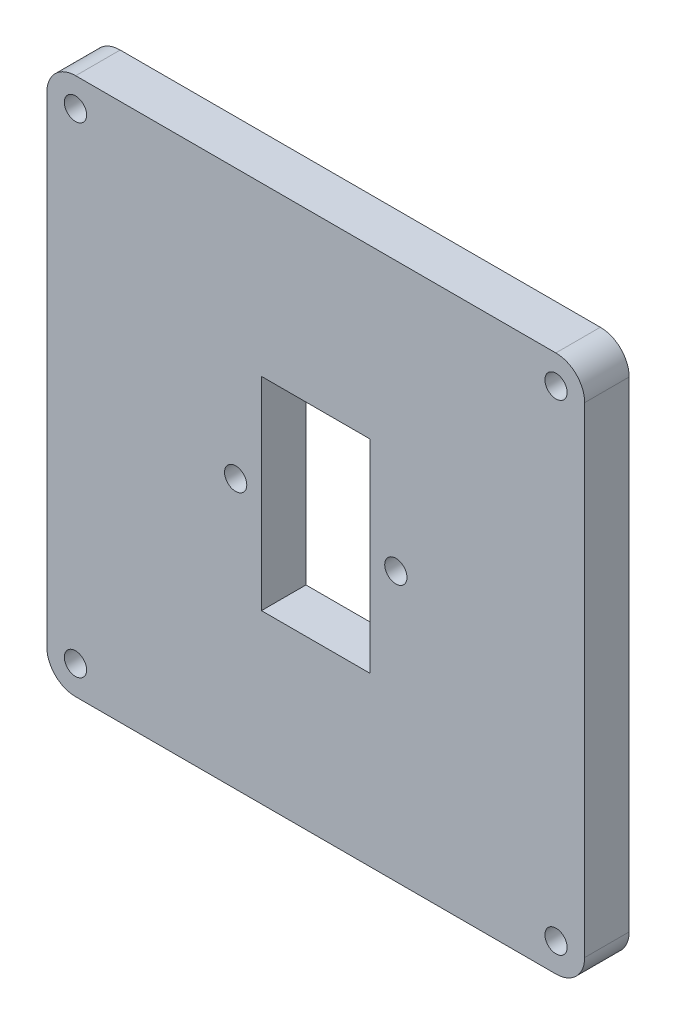
ISO-10303-21;
HEADER;
FILE_DESCRIPTION(('STEP AP214'),'2;1');
FILE_NAME('part.step','',(''),(''),'','','');
FILE_SCHEMA(('AUTOMOTIVE_DESIGN { 1 0 10303 214 1 1 1 1 }'));
ENDSEC;
DATA;
#1=APPLICATION_CONTEXT('core data for automotive mechanical design processes');
#2=APPLICATION_PROTOCOL_DEFINITION('international standard','automotive_design',2000,#1);
#3=PRODUCT_CONTEXT('',#1,'mechanical');
#4=PRODUCT('Part','Part','',(#3));
#5=PRODUCT_RELATED_PRODUCT_CATEGORY('part','',(#4));
#6=PRODUCT_DEFINITION_FORMATION('','',#4);
#7=PRODUCT_DEFINITION_CONTEXT('part definition',#1,'design');
#8=PRODUCT_DEFINITION('design','',#6,#7);
#9=PRODUCT_DEFINITION_SHAPE('','',#8);
#10=(LENGTH_UNIT() NAMED_UNIT(*) SI_UNIT(.MILLI.,.METRE.));
#11=(NAMED_UNIT(*) PLANE_ANGLE_UNIT() SI_UNIT($,.RADIAN.));
#12=(NAMED_UNIT(*) SI_UNIT($,.STERADIAN.) SOLID_ANGLE_UNIT());
#13=UNCERTAINTY_MEASURE_WITH_UNIT(LENGTH_MEASURE(1.E-05),#10,'distance_accuracy_value','');
#14=(GEOMETRIC_REPRESENTATION_CONTEXT(3) GLOBAL_UNCERTAINTY_ASSIGNED_CONTEXT((#13)) GLOBAL_UNIT_ASSIGNED_CONTEXT((#10,
#11,#12)) REPRESENTATION_CONTEXT('',''));
#15=CARTESIAN_POINT('',(0.,0.,0.));
#16=DIRECTION('',(0.,0.,1.));
#17=DIRECTION('',(1.,0.,0.));
#18=AXIS2_PLACEMENT_3D('',#15,#16,#17);
#19=CARTESIAN_POINT('',(0.,1640.52370089279,5.));
#20=DIRECTION('',(0.,1.,0.));
#21=DIRECTION('',(0.,0.,1.));
#22=AXIS2_PLACEMENT_3D('',#19,#20,#21);
#23=PLANE('',#22);
#24=DIRECTION('',(1.,0.,0.));
#25=VECTOR('',#24,1.);
#26=CARTESIAN_POINT('',(0.,1640.52370089279,0.));
#27=LINE('',#26,#25);
#28=CARTESIAN_POINT('',(2386.48084118591,1640.52370089279,0.));
#29=VERTEX_POINT('',#28);
#30=CARTESIAN_POINT('',(2440.43389202825,1640.52370089279,0.));
#31=VERTEX_POINT('',#30);
#32=EDGE_CURVE('E210',#29,#31,#27,.T.);
#33=ORIENTED_EDGE('',*,*,#32,.F.);
#34=DIRECTION('',(0.,0.,-1.));
#35=VECTOR('',#34,1.);
#36=CARTESIAN_POINT('',(2386.48084118591,1640.52370089279,5.));
#37=LINE('',#36,#35);
#38=CARTESIAN_POINT('',(2386.48084118591,1640.52370089279,5.));
#39=VERTEX_POINT('',#38);
#40=EDGE_CURVE('E11',#39,#29,#37,.T.);
#41=ORIENTED_EDGE('',*,*,#40,.F.);
#42=DIRECTION('',(1.,0.,0.));
#43=VECTOR('',#42,1.);
#44=CARTESIAN_POINT('',(0.,1640.52370089279,5.));
#45=LINE('',#44,#43);
#46=CARTESIAN_POINT('',(2440.43389202825,1640.52370089279,5.));
#47=VERTEX_POINT('',#46);
#48=EDGE_CURVE('E298',#39,#47,#45,.T.);
#49=ORIENTED_EDGE('',*,*,#48,.T.);
#50=DIRECTION('',(0.,0.,-1.));
#51=VECTOR('',#50,1.);
#52=CARTESIAN_POINT('',(2440.43389202825,1640.52370089279,5.));
#53=LINE('',#52,#51);
#54=EDGE_CURVE('E107',#47,#31,#53,.T.);
#55=ORIENTED_EDGE('',*,*,#54,.T.);
#56=EDGE_LOOP('',(#33,#41,#49,#55));
#57=FACE_BOUND('',#56,.T.);
#58=ADVANCED_FACE('F41',(#57),#23,.T.);
#59=CARTESIAN_POINT('',(2386.45736255729,1637.30587108874,5.));
#60=DIRECTION('',(0.,0.,-1.));
#61=DIRECTION('',(-1.,0.,0.));
#62=AXIS2_PLACEMENT_3D('',#59,#60,#61);
#63=CYLINDRICAL_SURFACE('',#62,3.21791545784592);
#64=CARTESIAN_POINT('',(2386.45736255729,1637.30587108874,0.));
#65=DIRECTION('',(0.,0.,1.));
#66=DIRECTION('',(1.,0.,0.));
#67=AXIS2_PLACEMENT_3D('',#64,#65,#66);
#68=CIRCLE('',#67,3.21791545784592);
#69=CARTESIAN_POINT('',(2383.23944711969,1637.30623207254,0.));
#70=VERTEX_POINT('',#69);
#71=EDGE_CURVE('E214',#29,#70,#68,.T.);
#72=ORIENTED_EDGE('',*,*,#71,.T.);
#73=DIRECTION('',(0.,0.,-1.));
#74=VECTOR('',#73,1.);
#75=CARTESIAN_POINT('',(2383.23944711969,1637.30623207254,5.));
#76=LINE('',#75,#74);
#77=CARTESIAN_POINT('',(2383.23944711969,1637.30623207254,5.));
#78=VERTEX_POINT('',#77);
#79=EDGE_CURVE('E52',#78,#70,#76,.T.);
#80=ORIENTED_EDGE('',*,*,#79,.F.);
#81=CARTESIAN_POINT('',(2386.45736255729,1637.30587108874,5.));
#82=DIRECTION('',(0.,0.,1.));
#83=DIRECTION('',(1.,0.,0.));
#84=AXIS2_PLACEMENT_3D('',#81,#82,#83);
#85=CIRCLE('',#84,3.21791545784592);
#86=EDGE_CURVE('E301',#39,#78,#85,.T.);
#87=ORIENTED_EDGE('',*,*,#86,.F.);
#88=ORIENTED_EDGE('',*,*,#40,.T.);
#89=EDGE_LOOP('',(#72,#80,#87,#88));
#90=FACE_BOUND('',#89,.T.);
#91=ADVANCED_FACE('F323',(#90),#63,.T.);
#92=CARTESIAN_POINT('',(2383.23944650581,-8.93553077367108E-07,5.));
#93=DIRECTION('',(-1.,3.74932144848975E-10,0.));
#94=DIRECTION('',(-3.74932144848975E-10,-1.,0.));
#95=AXIS2_PLACEMENT_3D('',#92,#93,#94);
#96=PLANE('',#95);
#97=DIRECTION('',(3.74932144848975E-10,1.,0.));
#98=VECTOR('',#97,1.);
#99=CARTESIAN_POINT('',(2383.23944650581,-8.93553077367108E-07,0.));
#100=LINE('',#99,#98);
#101=CARTESIAN_POINT('',(2383.23944709944,1583.30587108874,0.));
#102=VERTEX_POINT('',#101);
#103=EDGE_CURVE('E218',#102,#70,#100,.T.);
#104=ORIENTED_EDGE('',*,*,#103,.F.);
#105=DIRECTION('',(0.,0.,-1.));
#106=VECTOR('',#105,1.);
#107=CARTESIAN_POINT('',(2383.23944709944,1583.30587108874,5.));
#108=LINE('',#107,#106);
#109=CARTESIAN_POINT('',(2383.23944709944,1583.30587108874,5.));
#110=VERTEX_POINT('',#109);
#111=EDGE_CURVE('E248',#110,#102,#108,.T.);
#112=ORIENTED_EDGE('',*,*,#111,.F.);
#113=DIRECTION('',(3.74932144848975E-10,1.,0.));
#114=VECTOR('',#113,1.);
#115=CARTESIAN_POINT('',(2383.23944650581,-8.93553077367108E-07,5.));
#116=LINE('',#115,#114);
#117=EDGE_CURVE('E304',#110,#78,#116,.T.);
#118=ORIENTED_EDGE('',*,*,#117,.T.);
#119=ORIENTED_EDGE('',*,*,#79,.T.);
#120=EDGE_LOOP('',(#104,#112,#118,#119));
#121=FACE_BOUND('',#120,.T.);
#122=ADVANCED_FACE('F326',(#121),#96,.T.);
#123=CARTESIAN_POINT('',(2386.45736255729,1583.30587108874,5.));
#124=DIRECTION('',(0.,0.,-1.));
#125=DIRECTION('',(-1.,0.,0.));
#126=AXIS2_PLACEMENT_3D('',#123,#124,#125);
#127=CYLINDRICAL_SURFACE('',#126,3.21791545784508);
#128=CARTESIAN_POINT('',(2386.45736255729,1583.30587108874,0.));
#129=DIRECTION('',(0.,0.,1.));
#130=DIRECTION('',(1.,0.,0.));
#131=AXIS2_PLACEMENT_3D('',#128,#129,#130);
#132=CIRCLE('',#131,3.21791545784508);
#133=CARTESIAN_POINT('',(2386.48269411464,1580.08805533795,0.));
#134=VERTEX_POINT('',#133);
#135=EDGE_CURVE('E222',#102,#134,#132,.T.);
#136=ORIENTED_EDGE('',*,*,#135,.T.);
#137=DIRECTION('',(0.,0.,-1.));
#138=VECTOR('',#137,1.);
#139=CARTESIAN_POINT('',(2386.48269411464,1580.08805533795,5.));
#140=LINE('',#139,#138);
#141=CARTESIAN_POINT('',(2386.48269411464,1580.08805533795,5.));
#142=VERTEX_POINT('',#141);
#143=EDGE_CURVE('E245',#142,#134,#140,.T.);
#144=ORIENTED_EDGE('',*,*,#143,.F.);
#145=CARTESIAN_POINT('',(2386.45736255729,1583.30587108874,5.));
#146=DIRECTION('',(0.,0.,1.));
#147=DIRECTION('',(1.,0.,0.));
#148=AXIS2_PLACEMENT_3D('',#145,#146,#147);
#149=CIRCLE('',#148,3.21791545784508);
#150=EDGE_CURVE('E308',#110,#142,#149,.T.);
#151=ORIENTED_EDGE('',*,*,#150,.F.);
#152=ORIENTED_EDGE('',*,*,#111,.T.);
#153=EDGE_LOOP('',(#136,#144,#151,#152));
#154=FACE_BOUND('',#153,.T.);
#155=ADVANCED_FACE('F329',(#154),#127,.T.);
#156=CARTESIAN_POINT('',(1.95099696627954E-11,1580.08805533798,5.));
#157=DIRECTION('',(0.,-1.,0.));
#158=DIRECTION('',(1.,0.,0.));
#159=AXIS2_PLACEMENT_3D('',#156,#157,#158);
#160=PLANE('',#159);
#161=DIRECTION('',(-1.,0.,0.));
#162=VECTOR('',#161,1.);
#163=CARTESIAN_POINT('',(1.95099696627954E-11,1580.08805533798,0.));
#164=LINE('',#163,#162);
#165=CARTESIAN_POINT('',(2440.43203909953,1580.08805533795,0.));
#166=VERTEX_POINT('',#165);
#167=EDGE_CURVE('E226',#166,#134,#164,.T.);
#168=ORIENTED_EDGE('',*,*,#167,.F.);
#169=DIRECTION('',(0.,0.,-1.));
#170=VECTOR('',#169,1.);
#171=CARTESIAN_POINT('',(2440.43203909953,1580.08805533795,5.));
#172=LINE('',#171,#170);
#173=CARTESIAN_POINT('',(2440.43203909953,1580.08805533795,5.));
#174=VERTEX_POINT('',#173);
#175=EDGE_CURVE('E160',#174,#166,#172,.T.);
#176=ORIENTED_EDGE('',*,*,#175,.F.);
#177=DIRECTION('',(-1.,0.,0.));
#178=VECTOR('',#177,1.);
#179=CARTESIAN_POINT('',(1.95099696627954E-11,1580.08805533798,5.));
#180=LINE('',#179,#178);
#181=EDGE_CURVE('E147',#174,#142,#180,.T.);
#182=ORIENTED_EDGE('',*,*,#181,.T.);
#183=ORIENTED_EDGE('',*,*,#143,.T.);
#184=EDGE_LOOP('',(#168,#176,#182,#183));
#185=FACE_BOUND('',#184,.T.);
#186=ADVANCED_FACE('F313',(#185),#160,.T.);
#187=CARTESIAN_POINT('',(2440.45736255729,1583.30587108874,5.));
#188=DIRECTION('',(0.,0.,-1.));
#189=DIRECTION('',(-1.,0.,0.));
#190=AXIS2_PLACEMENT_3D('',#187,#188,#189);
#191=CYLINDRICAL_SURFACE('',#190,3.21791539409568);
#192=CARTESIAN_POINT('',(2440.45736255729,1583.30587108874,0.));
#193=DIRECTION('',(0.,0.,1.));
#194=DIRECTION('',(1.,0.,0.));
#195=AXIS2_PLACEMENT_3D('',#192,#193,#194);
#196=CIRCLE('',#195,3.21791539409568);
#197=CARTESIAN_POINT('',(2443.6752779334,1583.30621128496,0.));
#198=VERTEX_POINT('',#197);
#199=EDGE_CURVE('E155',#166,#198,#196,.T.);
#200=ORIENTED_EDGE('',*,*,#199,.T.);
#201=DIRECTION('',(0.,0.,-1.));
#202=VECTOR('',#201,1.);
#203=CARTESIAN_POINT('',(2443.6752779334,1583.30621128496,5.));
#204=LINE('',#203,#202);
#205=CARTESIAN_POINT('',(2443.6752779334,1583.30621128496,5.));
#206=VERTEX_POINT('',#205);
#207=EDGE_CURVE('E152',#206,#198,#204,.T.);
#208=ORIENTED_EDGE('',*,*,#207,.F.);
#209=CARTESIAN_POINT('',(2440.45736255729,1583.30587108874,5.));
#210=DIRECTION('',(0.,0.,1.));
#211=DIRECTION('',(1.,0.,0.));
#212=AXIS2_PLACEMENT_3D('',#209,#210,#211);
#213=CIRCLE('',#212,3.21791539409568);
#214=EDGE_CURVE('E141',#174,#206,#213,.T.);
#215=ORIENTED_EDGE('',*,*,#214,.F.);
#216=ORIENTED_EDGE('',*,*,#175,.T.);
#217=EDGE_LOOP('',(#200,#208,#215,#216));
#218=FACE_BOUND('',#217,.T.);
#219=ADVANCED_FACE('F153',(#218),#191,.T.);
#220=CARTESIAN_POINT('',(2443.67527793339,-2.00964627369217E-11,5.));
#221=DIRECTION('',(1.,0.,0.));
#222=DIRECTION('',(0.,1.,0.));
#223=AXIS2_PLACEMENT_3D('',#220,#221,#222);
#224=PLANE('',#223);
#225=DIRECTION('',(0.,-1.,0.));
#226=VECTOR('',#225,1.);
#227=CARTESIAN_POINT('',(2443.67527793339,-2.00964627369217E-11,0.));
#228=LINE('',#227,#226);
#229=CARTESIAN_POINT('',(2443.6752779334,1637.30625286012,0.));
#230=VERTEX_POINT('',#229);
#231=EDGE_CURVE('E232',#230,#198,#228,.T.);
#232=ORIENTED_EDGE('',*,*,#231,.F.);
#233=DIRECTION('',(0.,0.,-1.));
#234=VECTOR('',#233,1.);
#235=CARTESIAN_POINT('',(2443.6752779334,1637.30625286012,5.));
#236=LINE('',#235,#234);
#237=CARTESIAN_POINT('',(2443.6752779334,1637.30625286012,5.));
#238=VERTEX_POINT('',#237);
#239=EDGE_CURVE('E100',#238,#230,#236,.T.);
#240=ORIENTED_EDGE('',*,*,#239,.F.);
#241=DIRECTION('',(0.,-1.,0.));
#242=VECTOR('',#241,1.);
#243=CARTESIAN_POINT('',(2443.67527793339,-2.00964627369217E-11,5.));
#244=LINE('',#243,#242);
#245=EDGE_CURVE('E145',#238,#206,#244,.T.);
#246=ORIENTED_EDGE('',*,*,#245,.T.);
#247=ORIENTED_EDGE('',*,*,#207,.T.);
#248=EDGE_LOOP('',(#232,#240,#246,#247));
#249=FACE_BOUND('',#248,.T.);
#250=ADVANCED_FACE('F162',(#249),#224,.T.);
#251=CARTESIAN_POINT('',(2407.35736660709,0.,5.));
#252=DIRECTION('',(1.,0.,0.));
#253=DIRECTION('',(0.,0.,-1.));
#254=AXIS2_PLACEMENT_3D('',#251,#252,#253);
#255=PLANE('',#254);
#256=DIRECTION('',(0.,-1.,0.));
#257=VECTOR('',#256,1.);
#258=CARTESIAN_POINT('',(2407.35736660709,0.,0.));
#259=LINE('',#258,#257);
#260=CARTESIAN_POINT('',(2407.35736660709,1621.70623207254,0.));
#261=VERTEX_POINT('',#260);
#262=CARTESIAN_POINT('',(2407.35736660709,1598.90623207254,0.));
#263=VERTEX_POINT('',#262);
#264=EDGE_CURVE('E186',#261,#263,#259,.T.);
#265=ORIENTED_EDGE('',*,*,#264,.F.);
#266=DIRECTION('',(0.,0.,-1.));
#267=VECTOR('',#266,1.);
#268=CARTESIAN_POINT('',(2407.35736660709,1621.70623207254,5.));
#269=LINE('',#268,#267);
#270=CARTESIAN_POINT('',(2407.35736660709,1621.70623207254,5.));
#271=VERTEX_POINT('',#270);
#272=EDGE_CURVE('E45',#271,#261,#269,.T.);
#273=ORIENTED_EDGE('',*,*,#272,.F.);
#274=DIRECTION('',(0.,-1.,0.));
#275=VECTOR('',#274,1.);
#276=CARTESIAN_POINT('',(2407.35736660709,0.,5.));
#277=LINE('',#276,#275);
#278=CARTESIAN_POINT('',(2407.35736660709,1598.90623207254,5.));
#279=VERTEX_POINT('',#278);
#280=EDGE_CURVE('E530',#271,#279,#277,.T.);
#281=ORIENTED_EDGE('',*,*,#280,.T.);
#282=DIRECTION('',(0.,0.,-1.));
#283=VECTOR('',#282,1.);
#284=CARTESIAN_POINT('',(2407.35736660709,1598.90623207254,5.));
#285=LINE('',#284,#283);
#286=EDGE_CURVE('E166',#279,#263,#285,.T.);
#287=ORIENTED_EDGE('',*,*,#286,.T.);
#288=EDGE_LOOP('',(#265,#273,#281,#287));
#289=FACE_BOUND('',#288,.T.);
#290=ADVANCED_FACE('F269',(#289),#255,.T.);
#291=CARTESIAN_POINT('',(0.,1621.70623207254,5.));
#292=DIRECTION('',(0.,-1.,0.));
#293=DIRECTION('',(0.,0.,-1.));
#294=AXIS2_PLACEMENT_3D('',#291,#292,#293);
#295=PLANE('',#294);
#296=DIRECTION('',(-1.,0.,0.));
#297=VECTOR('',#296,1.);
#298=CARTESIAN_POINT('',(0.,1621.70623207254,0.));
#299=LINE('',#298,#297);
#300=CARTESIAN_POINT('',(2419.55736660709,1621.70623207254,0.));
#301=VERTEX_POINT('',#300);
#302=EDGE_CURVE('E190',#301,#261,#299,.T.);
#303=ORIENTED_EDGE('',*,*,#302,.F.);
#304=DIRECTION('',(0.,0.,-1.));
#305=VECTOR('',#304,1.);
#306=CARTESIAN_POINT('',(2419.55736660709,1621.70623207254,5.));
#307=LINE('',#306,#305);
#308=CARTESIAN_POINT('',(2419.55736660709,1621.70623207254,5.));
#309=VERTEX_POINT('',#308);
#310=EDGE_CURVE('E257',#309,#301,#307,.T.);
#311=ORIENTED_EDGE('',*,*,#310,.F.);
#312=DIRECTION('',(-1.,0.,0.));
#313=VECTOR('',#312,1.);
#314=CARTESIAN_POINT('',(0.,1621.70623207254,5.));
#315=LINE('',#314,#313);
#316=EDGE_CURVE('E268',#309,#271,#315,.T.);
#317=ORIENTED_EDGE('',*,*,#316,.T.);
#318=ORIENTED_EDGE('',*,*,#272,.T.);
#319=EDGE_LOOP('',(#303,#311,#317,#318));
#320=FACE_BOUND('',#319,.T.);
#321=ADVANCED_FACE('F266',(#320),#295,.T.);
#322=CARTESIAN_POINT('',(2419.55736660709,0.,5.));
#323=DIRECTION('',(-1.,0.,0.));
#324=DIRECTION('',(0.,0.,1.));
#325=AXIS2_PLACEMENT_3D('',#322,#323,#324);
#326=PLANE('',#325);
#327=DIRECTION('',(0.,1.,0.));
#328=VECTOR('',#327,1.);
#329=CARTESIAN_POINT('',(2419.55736660709,0.,0.));
#330=LINE('',#329,#328);
#331=CARTESIAN_POINT('',(2419.55736660709,1598.90623207254,0.));
#332=VERTEX_POINT('',#331);
#333=EDGE_CURVE('E194',#332,#301,#330,.T.);
#334=ORIENTED_EDGE('',*,*,#333,.F.);
#335=DIRECTION('',(0.,0.,-1.));
#336=VECTOR('',#335,1.);
#337=CARTESIAN_POINT('',(2419.55736660709,1598.90623207254,5.));
#338=LINE('',#337,#336);
#339=CARTESIAN_POINT('',(2419.55736660709,1598.90623207254,5.));
#340=VERTEX_POINT('',#339);
#341=EDGE_CURVE('E255',#340,#332,#338,.T.);
#342=ORIENTED_EDGE('',*,*,#341,.F.);
#343=DIRECTION('',(0.,1.,0.));
#344=VECTOR('',#343,1.);
#345=CARTESIAN_POINT('',(2419.55736660709,0.,5.));
#346=LINE('',#345,#344);
#347=EDGE_CURVE('E276',#340,#309,#346,.T.);
#348=ORIENTED_EDGE('',*,*,#347,.T.);
#349=ORIENTED_EDGE('',*,*,#310,.T.);
#350=EDGE_LOOP('',(#334,#342,#348,#349));
#351=FACE_BOUND('',#350,.T.);
#352=ADVANCED_FACE('F274',(#351),#326,.T.);
#353=CARTESIAN_POINT('',(2404.45736660709,1610.30623207254,5.));
#354=DIRECTION('',(0.,0.,-1.));
#355=DIRECTION('',(-1.,0.,0.));
#356=AXIS2_PLACEMENT_3D('',#353,#354,#355);
#357=CYLINDRICAL_SURFACE('',#356,1.25000000000008);
#358=CARTESIAN_POINT('',(2404.45736660709,1610.30623207254,5.));
#359=DIRECTION('',(0.,0.,1.));
#360=DIRECTION('',(1.,0.,0.));
#361=AXIS2_PLACEMENT_3D('',#358,#359,#360);
#362=CIRCLE('',#361,1.25000000000008);
#363=CARTESIAN_POINT('',(2405.70736660709,1610.30623207254,5.));
#364=VERTEX_POINT('',#363);
#365=EDGE_CURVE('E291',#364,#364,#362,.T.);
#366=ORIENTED_EDGE('',*,*,#365,.T.);
#367=EDGE_LOOP('',(#366));
#368=FACE_BOUND('',#367,.T.);
#369=CARTESIAN_POINT('',(2404.45736660709,1610.30623207254,0.));
#370=DIRECTION('',(0.,0.,1.));
#371=DIRECTION('',(1.,0.,0.));
#372=AXIS2_PLACEMENT_3D('',#369,#370,#371);
#373=CIRCLE('',#372,1.25000000000008);
#374=CARTESIAN_POINT('',(2405.70736660709,1610.30623207254,0.));
#375=VERTEX_POINT('',#374);
#376=EDGE_CURVE('E206',#375,#375,#373,.T.);
#377=ORIENTED_EDGE('',*,*,#376,.F.);
#378=EDGE_LOOP('',(#377));
#379=FACE_BOUND('',#378,.T.);
#380=ADVANCED_FACE('F345',(#368,#379),#357,.F.);
#381=CARTESIAN_POINT('',(2422.45736660709,1610.30623207254,5.));
#382=DIRECTION('',(0.,0.,-1.));
#383=DIRECTION('',(-1.,0.,0.));
#384=AXIS2_PLACEMENT_3D('',#381,#382,#383);
#385=CYLINDRICAL_SURFACE('',#384,1.25000000000008);
#386=CARTESIAN_POINT('',(2422.45736660709,1610.30623207254,5.));
#387=DIRECTION('',(0.,0.,1.));
#388=DIRECTION('',(1.,0.,0.));
#389=AXIS2_PLACEMENT_3D('',#386,#387,#388);
#390=CIRCLE('',#389,1.25000000000008);
#391=CARTESIAN_POINT('',(2423.70736660709,1610.30623207254,5.));
#392=VERTEX_POINT('',#391);
#393=EDGE_CURVE('E287',#392,#392,#390,.T.);
#394=ORIENTED_EDGE('',*,*,#393,.T.);
#395=EDGE_LOOP('',(#394));
#396=FACE_BOUND('',#395,.T.);
#397=CARTESIAN_POINT('',(2422.45736660709,1610.30623207254,0.));
#398=DIRECTION('',(0.,0.,1.));
#399=DIRECTION('',(1.,0.,0.));
#400=AXIS2_PLACEMENT_3D('',#397,#398,#399);
#401=CIRCLE('',#400,1.25000000000008);
#402=CARTESIAN_POINT('',(2423.70736660709,1610.30623207254,0.));
#403=VERTEX_POINT('',#402);
#404=EDGE_CURVE('E202',#403,#403,#401,.T.);
#405=ORIENTED_EDGE('',*,*,#404,.F.);
#406=EDGE_LOOP('',(#405));
#407=FACE_BOUND('',#406,.T.);
#408=ADVANCED_FACE('F348',(#396,#407),#385,.F.);
#409=CARTESIAN_POINT('',(0.,1598.90623207254,5.));
#410=DIRECTION('',(0.,1.,0.));
#411=DIRECTION('',(0.,0.,1.));
#412=AXIS2_PLACEMENT_3D('',#409,#410,#411);
#413=PLANE('',#412);
#414=DIRECTION('',(1.,0.,0.));
#415=VECTOR('',#414,1.);
#416=CARTESIAN_POINT('',(0.,1598.90623207254,0.));
#417=LINE('',#416,#415);
#418=EDGE_CURVE('E198',#263,#332,#417,.T.);
#419=ORIENTED_EDGE('',*,*,#418,.F.);
#420=ORIENTED_EDGE('',*,*,#286,.F.);
#421=DIRECTION('',(1.,0.,0.));
#422=VECTOR('',#421,1.);
#423=CARTESIAN_POINT('',(0.,1598.90623207254,5.));
#424=LINE('',#423,#422);
#425=EDGE_CURVE('E282',#279,#340,#424,.T.);
#426=ORIENTED_EDGE('',*,*,#425,.T.);
#427=ORIENTED_EDGE('',*,*,#341,.T.);
#428=EDGE_LOOP('',(#419,#420,#426,#427));
#429=FACE_BOUND('',#428,.T.);
#430=ADVANCED_FACE('F285',(#429),#413,.T.);
#431=CARTESIAN_POINT('',(2440.45736255729,1637.30587108874,5.));
#432=DIRECTION('',(0.,0.,-1.));
#433=DIRECTION('',(-1.,0.,0.));
#434=AXIS2_PLACEMENT_3D('',#431,#432,#433);
#435=CYLINDRICAL_SURFACE('',#434,1.25000000000008);
#436=CARTESIAN_POINT('',(2440.45736255729,1637.30587108874,5.));
#437=DIRECTION('',(0.,0.,1.));
#438=DIRECTION('',(1.,0.,0.));
#439=AXIS2_PLACEMENT_3D('',#436,#437,#438);
#440=CIRCLE('',#439,1.25000000000008);
#441=CARTESIAN_POINT('',(2441.70736255729,1637.30587108874,5.));
#442=VERTEX_POINT('',#441);
#443=EDGE_CURVE('E528',#442,#442,#440,.T.);
#444=ORIENTED_EDGE('',*,*,#443,.T.);
#445=EDGE_LOOP('',(#444));
#446=FACE_BOUND('',#445,.T.);
#447=CARTESIAN_POINT('',(2440.45736255729,1637.30587108874,0.));
#448=DIRECTION('',(0.,0.,1.));
#449=DIRECTION('',(1.,0.,0.));
#450=AXIS2_PLACEMENT_3D('',#447,#448,#449);
#451=CIRCLE('',#450,1.25000000000008);
#452=CARTESIAN_POINT('',(2441.70736255729,1637.30587108874,0.));
#453=VERTEX_POINT('',#452);
#454=EDGE_CURVE('E182',#453,#453,#451,.T.);
#455=ORIENTED_EDGE('',*,*,#454,.F.);
#456=EDGE_LOOP('',(#455));
#457=FACE_BOUND('',#456,.T.);
#458=ADVANCED_FACE('F355',(#446,#457),#435,.F.);
#459=CARTESIAN_POINT('',(2440.45736255729,1583.30587108874,5.));
#460=DIRECTION('',(0.,0.,-1.));
#461=DIRECTION('',(-1.,0.,0.));
#462=AXIS2_PLACEMENT_3D('',#459,#460,#461);
#463=CYLINDRICAL_SURFACE('',#462,1.25000000000008);
#464=CARTESIAN_POINT('',(2440.45736255729,1583.30587108874,5.));
#465=DIRECTION('',(0.,0.,1.));
#466=DIRECTION('',(1.,0.,0.));
#467=AXIS2_PLACEMENT_3D('',#464,#465,#466);
#468=CIRCLE('',#467,1.25000000000008);
#469=CARTESIAN_POINT('',(2441.70736255729,1583.30587108874,5.));
#470=VERTEX_POINT('',#469);
#471=EDGE_CURVE('E525',#470,#470,#468,.T.);
#472=ORIENTED_EDGE('',*,*,#471,.T.);
#473=EDGE_LOOP('',(#472));
#474=FACE_BOUND('',#473,.T.);
#475=CARTESIAN_POINT('',(2440.45736255729,1583.30587108874,0.));
#476=DIRECTION('',(0.,0.,1.));
#477=DIRECTION('',(1.,0.,0.));
#478=AXIS2_PLACEMENT_3D('',#475,#476,#477);
#479=CIRCLE('',#478,1.25000000000008);
#480=CARTESIAN_POINT('',(2441.70736255729,1583.30587108874,0.));
#481=VERTEX_POINT('',#480);
#482=EDGE_CURVE('E178',#481,#481,#479,.T.);
#483=ORIENTED_EDGE('',*,*,#482,.F.);
#484=EDGE_LOOP('',(#483));
#485=FACE_BOUND('',#484,.T.);
#486=ADVANCED_FACE('F364',(#474,#485),#463,.F.);
#487=CARTESIAN_POINT('',(2386.45736255729,1583.30587108874,5.));
#488=DIRECTION('',(0.,0.,-1.));
#489=DIRECTION('',(-1.,0.,0.));
#490=AXIS2_PLACEMENT_3D('',#487,#488,#489);
#491=CYLINDRICAL_SURFACE('',#490,1.25000000000008);
#492=CARTESIAN_POINT('',(2386.45736255729,1583.30587108874,5.));
#493=DIRECTION('',(0.,0.,1.));
#494=DIRECTION('',(1.,0.,0.));
#495=AXIS2_PLACEMENT_3D('',#492,#493,#494);
#496=CIRCLE('',#495,1.25000000000008);
#497=CARTESIAN_POINT('',(2387.70736255729,1583.30587108874,5.));
#498=VERTEX_POINT('',#497);
#499=EDGE_CURVE('E378',#498,#498,#496,.T.);
#500=ORIENTED_EDGE('',*,*,#499,.T.);
#501=EDGE_LOOP('',(#500));
#502=FACE_BOUND('',#501,.T.);
#503=CARTESIAN_POINT('',(2386.45736255729,1583.30587108874,0.));
#504=DIRECTION('',(0.,0.,1.));
#505=DIRECTION('',(1.,0.,0.));
#506=AXIS2_PLACEMENT_3D('',#503,#504,#505);
#507=CIRCLE('',#506,1.25000000000008);
#508=CARTESIAN_POINT('',(2387.70736255729,1583.30587108874,0.));
#509=VERTEX_POINT('',#508);
#510=EDGE_CURVE('E174',#509,#509,#507,.T.);
#511=ORIENTED_EDGE('',*,*,#510,.F.);
#512=EDGE_LOOP('',(#511));
#513=FACE_BOUND('',#512,.T.);
#514=ADVANCED_FACE('F367',(#502,#513),#491,.F.);
#515=CARTESIAN_POINT('',(2386.45736255729,1637.30587108874,5.));
#516=DIRECTION('',(0.,0.,-1.));
#517=DIRECTION('',(-1.,0.,0.));
#518=AXIS2_PLACEMENT_3D('',#515,#516,#517);
#519=CYLINDRICAL_SURFACE('',#518,1.25000000000008);
#520=CARTESIAN_POINT('',(2386.45736255729,1637.30587108874,5.));
#521=DIRECTION('',(0.,0.,1.));
#522=DIRECTION('',(1.,0.,0.));
#523=AXIS2_PLACEMENT_3D('',#520,#521,#522);
#524=CIRCLE('',#523,1.25000000000008);
#525=CARTESIAN_POINT('',(2387.70736255729,1637.30587108874,5.));
#526=VERTEX_POINT('',#525);
#527=EDGE_CURVE('E238',#526,#526,#524,.T.);
#528=ORIENTED_EDGE('',*,*,#527,.T.);
#529=EDGE_LOOP('',(#528));
#530=FACE_BOUND('',#529,.T.);
#531=CARTESIAN_POINT('',(2386.45736255729,1637.30587108874,0.));
#532=DIRECTION('',(0.,0.,1.));
#533=DIRECTION('',(1.,0.,0.));
#534=AXIS2_PLACEMENT_3D('',#531,#532,#533);
#535=CIRCLE('',#534,1.25000000000008);
#536=CARTESIAN_POINT('',(2387.70736255729,1637.30587108874,0.));
#537=VERTEX_POINT('',#536);
#538=EDGE_CURVE('E170',#537,#537,#535,.T.);
#539=ORIENTED_EDGE('',*,*,#538,.F.);
#540=EDGE_LOOP('',(#539));
#541=FACE_BOUND('',#540,.T.);
#542=ADVANCED_FACE('F43',(#530,#541),#519,.F.);
#543=CARTESIAN_POINT('',(2440.45736255729,1637.30587108874,5.));
#544=DIRECTION('',(0.,0.,-1.));
#545=DIRECTION('',(-1.,0.,0.));
#546=AXIS2_PLACEMENT_3D('',#543,#544,#545);
#547=CYLINDRICAL_SURFACE('',#546,3.21791539875985);
#548=CARTESIAN_POINT('',(2440.45736255729,1637.30587108874,0.));
#549=DIRECTION('',(0.,0.,1.));
#550=DIRECTION('',(1.,0.,0.));
#551=AXIS2_PLACEMENT_3D('',#548,#549,#550);
#552=CIRCLE('',#551,3.21791539875985);
#553=EDGE_CURVE('E235',#230,#31,#552,.T.);
#554=ORIENTED_EDGE('',*,*,#553,.T.);
#555=ORIENTED_EDGE('',*,*,#54,.F.);
#556=CARTESIAN_POINT('',(2440.45736255729,1637.30587108874,5.));
#557=DIRECTION('',(0.,0.,1.));
#558=DIRECTION('',(1.,0.,0.));
#559=AXIS2_PLACEMENT_3D('',#556,#557,#558);
#560=CIRCLE('',#559,3.21791539875985);
#561=EDGE_CURVE('E61',#238,#47,#560,.T.);
#562=ORIENTED_EDGE('',*,*,#561,.F.);
#563=ORIENTED_EDGE('',*,*,#239,.T.);
#564=EDGE_LOOP('',(#554,#555,#562,#563));
#565=FACE_BOUND('',#564,.T.);
#566=ADVANCED_FACE('F318',(#565),#547,.T.);
#567=CARTESIAN_POINT('',(0.,0.,5.));
#568=DIRECTION('',(0.,0.,1.));
#569=DIRECTION('',(1.,0.,0.));
#570=AXIS2_PLACEMENT_3D('',#567,#568,#569);
#571=PLANE('',#570);
#572=ORIENTED_EDGE('',*,*,#527,.F.);
#573=EDGE_LOOP('',(#572));
#574=FACE_BOUND('',#573,.T.);
#575=ORIENTED_EDGE('',*,*,#499,.F.);
#576=EDGE_LOOP('',(#575));
#577=FACE_BOUND('',#576,.T.);
#578=ORIENTED_EDGE('',*,*,#471,.F.);
#579=EDGE_LOOP('',(#578));
#580=FACE_BOUND('',#579,.T.);
#581=ORIENTED_EDGE('',*,*,#443,.F.);
#582=EDGE_LOOP('',(#581));
#583=FACE_BOUND('',#582,.T.);
#584=ORIENTED_EDGE('',*,*,#280,.F.);
#585=ORIENTED_EDGE('',*,*,#316,.F.);
#586=ORIENTED_EDGE('',*,*,#347,.F.);
#587=ORIENTED_EDGE('',*,*,#425,.F.);
#588=EDGE_LOOP('',(#584,#585,#586,#587));
#589=FACE_BOUND('',#588,.T.);
#590=ORIENTED_EDGE('',*,*,#393,.F.);
#591=EDGE_LOOP('',(#590));
#592=FACE_BOUND('',#591,.T.);
#593=ORIENTED_EDGE('',*,*,#365,.F.);
#594=EDGE_LOOP('',(#593));
#595=FACE_BOUND('',#594,.T.);
#596=ORIENTED_EDGE('',*,*,#48,.F.);
#597=ORIENTED_EDGE('',*,*,#86,.T.);
#598=ORIENTED_EDGE('',*,*,#117,.F.);
#599=ORIENTED_EDGE('',*,*,#150,.T.);
#600=ORIENTED_EDGE('',*,*,#181,.F.);
#601=ORIENTED_EDGE('',*,*,#214,.T.);
#602=ORIENTED_EDGE('',*,*,#245,.F.);
#603=ORIENTED_EDGE('',*,*,#561,.T.);
#604=EDGE_LOOP('',(#596,#597,#598,#599,#600,#601,#602,#603));
#605=FACE_BOUND('',#604,.T.);
#606=ADVANCED_FACE('F143',(#574,#577,#580,#583,#589,#592,#595,#605),#571,.T.);
#607=CARTESIAN_POINT('',(0.,0.,0.));
#608=DIRECTION('',(0.,0.,1.));
#609=DIRECTION('',(1.,0.,0.));
#610=AXIS2_PLACEMENT_3D('',#607,#608,#609);
#611=PLANE('',#610);
#612=ORIENTED_EDGE('',*,*,#538,.T.);
#613=EDGE_LOOP('',(#612));
#614=FACE_BOUND('',#613,.T.);
#615=ORIENTED_EDGE('',*,*,#510,.T.);
#616=EDGE_LOOP('',(#615));
#617=FACE_BOUND('',#616,.T.);
#618=ORIENTED_EDGE('',*,*,#482,.T.);
#619=EDGE_LOOP('',(#618));
#620=FACE_BOUND('',#619,.T.);
#621=ORIENTED_EDGE('',*,*,#454,.T.);
#622=EDGE_LOOP('',(#621));
#623=FACE_BOUND('',#622,.T.);
#624=ORIENTED_EDGE('',*,*,#264,.T.);
#625=ORIENTED_EDGE('',*,*,#418,.T.);
#626=ORIENTED_EDGE('',*,*,#333,.T.);
#627=ORIENTED_EDGE('',*,*,#302,.T.);
#628=EDGE_LOOP('',(#624,#625,#626,#627));
#629=FACE_BOUND('',#628,.T.);
#630=ORIENTED_EDGE('',*,*,#404,.T.);
#631=EDGE_LOOP('',(#630));
#632=FACE_BOUND('',#631,.T.);
#633=ORIENTED_EDGE('',*,*,#376,.T.);
#634=EDGE_LOOP('',(#633));
#635=FACE_BOUND('',#634,.T.);
#636=ORIENTED_EDGE('',*,*,#32,.T.);
#637=ORIENTED_EDGE('',*,*,#553,.F.);
#638=ORIENTED_EDGE('',*,*,#231,.T.);
#639=ORIENTED_EDGE('',*,*,#199,.F.);
#640=ORIENTED_EDGE('',*,*,#167,.T.);
#641=ORIENTED_EDGE('',*,*,#135,.F.);
#642=ORIENTED_EDGE('',*,*,#103,.T.);
#643=ORIENTED_EDGE('',*,*,#71,.F.);
#644=EDGE_LOOP('',(#636,#637,#638,#639,#640,#641,#642,#643));
#645=FACE_BOUND('',#644,.T.);
#646=ADVANCED_FACE('F272',(#614,#617,#620,#623,#629,#632,#635,#645),#611,.F.);
#647=CLOSED_SHELL('',(#58,#91,#122,#155,#186,#219,#250,#290,#321,#352,#380,#408,#430,#458,#486,
#514,#542,#566,#606,#646));
#648=MANIFOLD_SOLID_BREP('B2',#647);
#649=ADVANCED_BREP_SHAPE_REPRESENTATION('',(#18,#648),#14);
#650=SHAPE_DEFINITION_REPRESENTATION(#9,#649);
ENDSEC;
END-ISO-10303-21;
